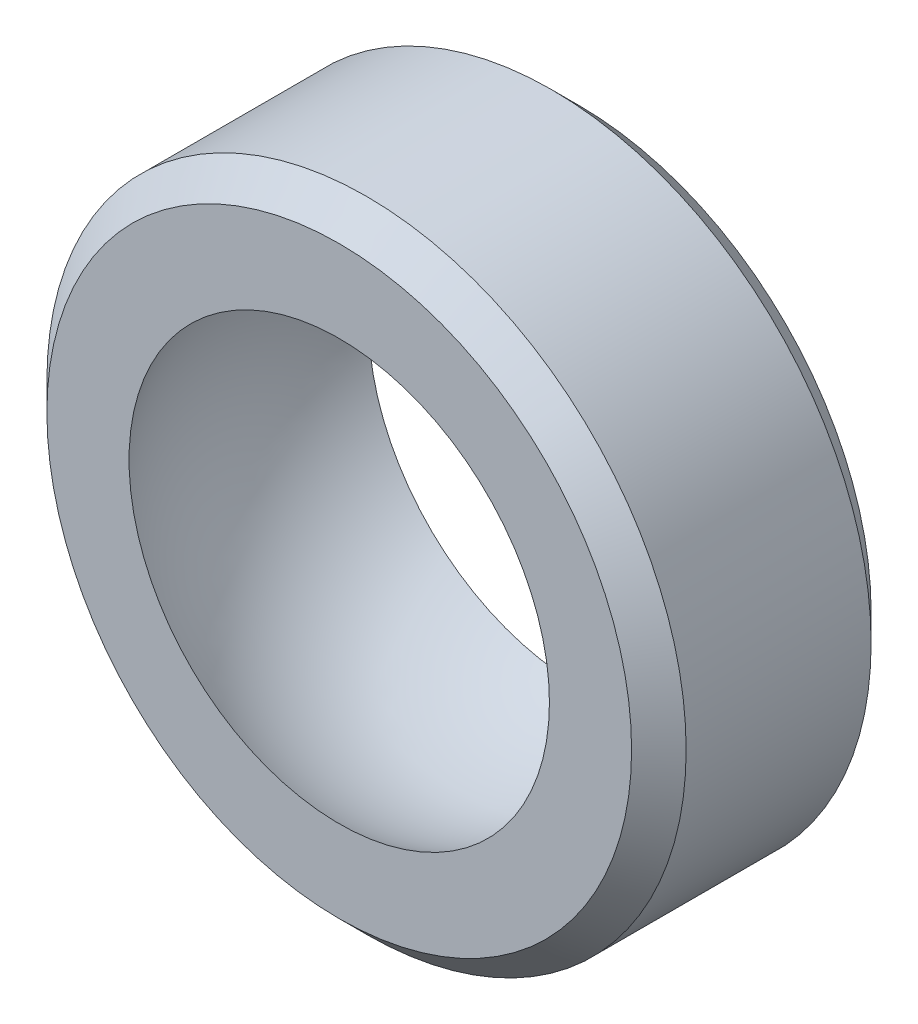
ISO-10303-21;
HEADER;
FILE_DESCRIPTION(('STEP AP214'),'2;1');
FILE_NAME('part.step','',(''),(''),'','','');
FILE_SCHEMA(('AUTOMOTIVE_DESIGN { 1 0 10303 214 1 1 1 1 }'));
ENDSEC;
DATA;
#1=APPLICATION_CONTEXT('core data for automotive mechanical design processes');
#2=APPLICATION_PROTOCOL_DEFINITION('international standard','automotive_design',2000,#1);
#3=PRODUCT_CONTEXT('',#1,'mechanical');
#4=PRODUCT('Part','Part','',(#3));
#5=PRODUCT_RELATED_PRODUCT_CATEGORY('part','',(#4));
#6=PRODUCT_DEFINITION_FORMATION('','',#4);
#7=PRODUCT_DEFINITION_CONTEXT('part definition',#1,'design');
#8=PRODUCT_DEFINITION('design','',#6,#7);
#9=PRODUCT_DEFINITION_SHAPE('','',#8);
#10=(LENGTH_UNIT() NAMED_UNIT(*) SI_UNIT(.MILLI.,.METRE.));
#11=(NAMED_UNIT(*) PLANE_ANGLE_UNIT() SI_UNIT($,.RADIAN.));
#12=(NAMED_UNIT(*) SI_UNIT($,.STERADIAN.) SOLID_ANGLE_UNIT());
#13=UNCERTAINTY_MEASURE_WITH_UNIT(LENGTH_MEASURE(1.E-05),#10,'distance_accuracy_value','');
#14=(GEOMETRIC_REPRESENTATION_CONTEXT(3) GLOBAL_UNCERTAINTY_ASSIGNED_CONTEXT((#13)) GLOBAL_UNIT_ASSIGNED_CONTEXT((#10,
#11,#12)) REPRESENTATION_CONTEXT('',''));
#15=CARTESIAN_POINT('',(0.,0.,0.));
#16=DIRECTION('',(0.,0.,1.));
#17=DIRECTION('',(1.,0.,0.));
#18=AXIS2_PLACEMENT_3D('',#15,#16,#17);
#19=CARTESIAN_POINT('',(0.,0.,3.5687));
#20=DIRECTION('',(0.,0.,-1.));
#21=DIRECTION('',(-1.,0.,0.));
#22=AXIS2_PLACEMENT_3D('',#19,#20,#21);
#23=CYLINDRICAL_SURFACE('',#22,9.525);
#24=CARTESIAN_POINT('',(0.,0.,2.7559));
#25=DIRECTION('',(0.,0.,1.));
#26=DIRECTION('',(1.,0.,0.));
#27=AXIS2_PLACEMENT_3D('',#24,#25,#26);
#28=CIRCLE('',#27,9.525);
#29=CARTESIAN_POINT('',(9.525,0.,2.7559));
#30=VERTEX_POINT('',#29);
#31=EDGE_CURVE('E48',#30,#30,#28,.F.);
#32=ORIENTED_EDGE('',*,*,#31,.T.);
#33=EDGE_LOOP('',(#32));
#34=FACE_BOUND('',#33,.T.);
#35=CARTESIAN_POINT('',(0.,0.,-2.7559));
#36=DIRECTION('',(0.,0.,1.));
#37=DIRECTION('',(1.,0.,0.));
#38=AXIS2_PLACEMENT_3D('',#35,#36,#37);
#39=CIRCLE('',#38,9.525);
#40=CARTESIAN_POINT('',(9.525,0.,-2.7559));
#41=VERTEX_POINT('',#40);
#42=EDGE_CURVE('E52',#41,#41,#39,.T.);
#43=ORIENTED_EDGE('',*,*,#42,.T.);
#44=EDGE_LOOP('',(#43));
#45=FACE_BOUND('',#44,.T.);
#46=ADVANCED_FACE('F41',(#34,#45),#23,.T.);
#47=CARTESIAN_POINT('',(0.,0.,3.5687));
#48=DIRECTION('',(0.,0.,1.));
#49=DIRECTION('',(1.,0.,0.));
#50=AXIS2_PLACEMENT_3D('',#47,#48,#49);
#51=PLANE('',#50);
#52=CARTESIAN_POINT('',(0.,0.,3.5687));
#53=DIRECTION('',(0.,0.,1.));
#54=DIRECTION('',(1.,0.,0.));
#55=AXIS2_PLACEMENT_3D('',#52,#53,#54);
#56=CIRCLE('',#55,8.7122);
#57=CARTESIAN_POINT('',(8.7122,0.,3.5687));
#58=VERTEX_POINT('',#57);
#59=EDGE_CURVE('E56',#58,#58,#56,.T.);
#60=ORIENTED_EDGE('',*,*,#59,.T.);
#61=EDGE_LOOP('',(#60));
#62=FACE_BOUND('',#61,.T.);
#63=CARTESIAN_POINT('',(0.,0.,3.5687));
#64=DIRECTION('',(0.,0.,1.));
#65=DIRECTION('',(1.,0.,0.));
#66=AXIS2_PLACEMENT_3D('',#63,#64,#65);
#67=CIRCLE('',#66,6.26344975976307);
#68=CARTESIAN_POINT('',(6.26344975976307,0.,3.5687));
#69=VERTEX_POINT('',#68);
#70=EDGE_CURVE('E61',#69,#69,#67,.T.);
#71=ORIENTED_EDGE('',*,*,#70,.F.);
#72=EDGE_LOOP('',(#71));
#73=FACE_BOUND('',#72,.T.);
#74=ADVANCED_FACE('F71',(#62,#73),#51,.T.);
#75=CARTESIAN_POINT('',(0.,0.,-3.5687));
#76=DIRECTION('',(0.,0.,1.));
#77=DIRECTION('',(1.,0.,0.));
#78=AXIS2_PLACEMENT_3D('',#75,#76,#77);
#79=PLANE('',#78);
#80=CARTESIAN_POINT('',(0.,0.,-3.5687));
#81=DIRECTION('',(0.,0.,1.));
#82=DIRECTION('',(1.,0.,0.));
#83=AXIS2_PLACEMENT_3D('',#80,#81,#82);
#84=CIRCLE('',#83,8.7122);
#85=CARTESIAN_POINT('',(8.7122,0.,-3.5687));
#86=VERTEX_POINT('',#85);
#87=EDGE_CURVE('E10',#86,#86,#84,.F.);
#88=ORIENTED_EDGE('',*,*,#87,.T.);
#89=EDGE_LOOP('',(#88));
#90=FACE_BOUND('',#89,.T.);
#91=CARTESIAN_POINT('',(0.,0.,-3.5687));
#92=DIRECTION('',(0.,0.,1.));
#93=DIRECTION('',(1.,0.,0.));
#94=AXIS2_PLACEMENT_3D('',#91,#92,#93);
#95=CIRCLE('',#94,6.26344975976307);
#96=CARTESIAN_POINT('',(6.26344975976307,0.,-3.5687));
#97=VERTEX_POINT('',#96);
#98=EDGE_CURVE('E62',#97,#97,#95,.T.);
#99=ORIENTED_EDGE('',*,*,#98,.T.);
#100=EDGE_LOOP('',(#99));
#101=FACE_BOUND('',#100,.T.);
#102=ADVANCED_FACE('F73',(#90,#101),#79,.F.);
#103=CARTESIAN_POINT('',(0.,0.,0.));
#104=DIRECTION('',(0.,-1.,0.));
#105=DIRECTION('',(-1.,0.,0.));
#106=AXIS2_PLACEMENT_3D('',#103,#104,#105);
#107=SPHERICAL_SURFACE('',#106,7.208774);
#108=CARTESIAN_POINT('',(0.,0.,0.));
#109=DIRECTION('',(0.,0.,1.));
#110=DIRECTION('',(1.,0.,0.));
#111=AXIS2_PLACEMENT_3D('',#108,#109,#110);
#112=SPHERICAL_SURFACE('',#111,7.208774);
#113=ORIENTED_EDGE('',*,*,#70,.T.);
#114=EDGE_LOOP('',(#113));
#115=FACE_BOUND('',#114,.T.);
#116=ORIENTED_EDGE('',*,*,#98,.F.);
#117=EDGE_LOOP('',(#116));
#118=FACE_BOUND('',#117,.T.);
#119=ADVANCED_FACE('F68',(#115,#118),#112,.F.);
#120=CARTESIAN_POINT('',(0.,0.,3.5687));
#121=DIRECTION('',(0.,0.,-1.));
#122=DIRECTION('',(-1.,0.,0.));
#123=AXIS2_PLACEMENT_3D('',#120,#121,#122);
#124=CONICAL_SURFACE('',#123,8.7122,0.785398163397446);
#125=ORIENTED_EDGE('',*,*,#31,.F.);
#126=EDGE_LOOP('',(#125));
#127=FACE_BOUND('',#126,.T.);
#128=ORIENTED_EDGE('',*,*,#59,.F.);
#129=EDGE_LOOP('',(#128));
#130=FACE_BOUND('',#129,.T.);
#131=ADVANCED_FACE('F83',(#127,#130),#124,.T.);
#132=CARTESIAN_POINT('',(0.,0.,-2.7559));
#133=DIRECTION('',(0.,0.,1.));
#134=DIRECTION('',(1.,0.,0.));
#135=AXIS2_PLACEMENT_3D('',#132,#133,#134);
#136=CONICAL_SURFACE('',#135,9.525,0.78539816339745);
#137=ORIENTED_EDGE('',*,*,#87,.F.);
#138=EDGE_LOOP('',(#137));
#139=FACE_BOUND('',#138,.T.);
#140=ORIENTED_EDGE('',*,*,#42,.F.);
#141=EDGE_LOOP('',(#140));
#142=FACE_BOUND('',#141,.T.);
#143=ADVANCED_FACE('F43',(#139,#142),#136,.T.);
#144=CLOSED_SHELL('',(#46,#74,#102,#119,#131,#143));
#145=MANIFOLD_SOLID_BREP('B2',#144);
#146=ADVANCED_BREP_SHAPE_REPRESENTATION('',(#18,#145),#14);
#147=SHAPE_DEFINITION_REPRESENTATION(#9,#146);
ENDSEC;
END-ISO-10303-21;
